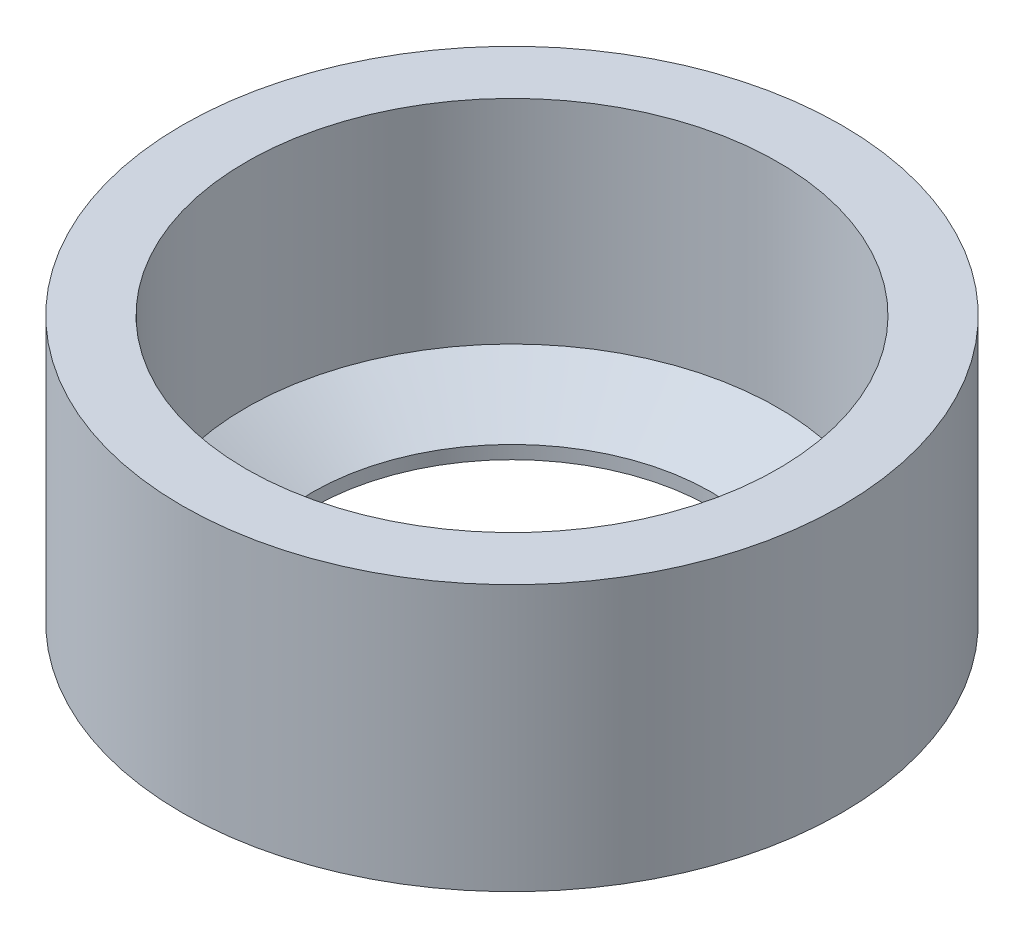
ISO-10303-21;
HEADER;
FILE_DESCRIPTION(('STEP AP214'),'2;1');
FILE_NAME('part.step','',(''),(''),'','','');
FILE_SCHEMA(('AUTOMOTIVE_DESIGN { 1 0 10303 214 1 1 1 1 }'));
ENDSEC;
DATA;
#1=APPLICATION_CONTEXT('core data for automotive mechanical design processes');
#2=APPLICATION_PROTOCOL_DEFINITION('international standard','automotive_design',2000,#1);
#3=PRODUCT_CONTEXT('',#1,'mechanical');
#4=PRODUCT('Part','Part','',(#3));
#5=PRODUCT_RELATED_PRODUCT_CATEGORY('part','',(#4));
#6=PRODUCT_DEFINITION_FORMATION('','',#4);
#7=PRODUCT_DEFINITION_CONTEXT('part definition',#1,'design');
#8=PRODUCT_DEFINITION('design','',#6,#7);
#9=PRODUCT_DEFINITION_SHAPE('','',#8);
#10=(LENGTH_UNIT() NAMED_UNIT(*) SI_UNIT(.MILLI.,.METRE.));
#11=(NAMED_UNIT(*) PLANE_ANGLE_UNIT() SI_UNIT($,.RADIAN.));
#12=(NAMED_UNIT(*) SI_UNIT($,.STERADIAN.) SOLID_ANGLE_UNIT());
#13=UNCERTAINTY_MEASURE_WITH_UNIT(LENGTH_MEASURE(1.E-05),#10,'distance_accuracy_value','');
#14=(GEOMETRIC_REPRESENTATION_CONTEXT(3) GLOBAL_UNCERTAINTY_ASSIGNED_CONTEXT((#13)) GLOBAL_UNIT_ASSIGNED_CONTEXT((#10,
#11,#12)) REPRESENTATION_CONTEXT('',''));
#15=CARTESIAN_POINT('',(0.,0.,0.));
#16=DIRECTION('',(0.,0.,1.));
#17=DIRECTION('',(1.,0.,0.));
#18=AXIS2_PLACEMENT_3D('',#15,#16,#17);
#19=CARTESIAN_POINT('',(0.,12.7,0.));
#20=DIRECTION('',(0.,-1.,0.));
#21=DIRECTION('',(0.,0.,-1.));
#22=AXIS2_PLACEMENT_3D('',#19,#20,#21);
#23=CYLINDRICAL_SURFACE('',#22,15.748);
#24=CARTESIAN_POINT('',(0.,12.7,0.));
#25=DIRECTION('',(0.,1.,0.));
#26=DIRECTION('',(0.,0.,1.));
#27=AXIS2_PLACEMENT_3D('',#24,#25,#26);
#28=CIRCLE('',#27,15.748);
#29=CARTESIAN_POINT('',(0.,12.7,15.748));
#30=VERTEX_POINT('',#29);
#31=EDGE_CURVE('E10',#30,#30,#28,.T.);
#32=ORIENTED_EDGE('',*,*,#31,.F.);
#33=EDGE_LOOP('',(#32));
#34=FACE_BOUND('',#33,.T.);
#35=CARTESIAN_POINT('',(0.,0.,0.));
#36=DIRECTION('',(0.,1.,0.));
#37=DIRECTION('',(0.,0.,1.));
#38=AXIS2_PLACEMENT_3D('',#35,#36,#37);
#39=CIRCLE('',#38,15.748);
#40=CARTESIAN_POINT('',(0.,0.,15.748));
#41=VERTEX_POINT('',#40);
#42=EDGE_CURVE('E42',#41,#41,#39,.T.);
#43=ORIENTED_EDGE('',*,*,#42,.T.);
#44=EDGE_LOOP('',(#43));
#45=FACE_BOUND('',#44,.T.);
#46=ADVANCED_FACE('F35',(#34,#45),#23,.T.);
#47=CARTESIAN_POINT('',(0.,12.7,0.));
#48=DIRECTION('',(0.,1.,0.));
#49=DIRECTION('',(0.,0.,1.));
#50=AXIS2_PLACEMENT_3D('',#47,#48,#49);
#51=PLANE('',#50);
#52=CARTESIAN_POINT('',(0.,12.7,0.));
#53=DIRECTION('',(0.,1.,0.));
#54=DIRECTION('',(0.,0.,1.));
#55=AXIS2_PLACEMENT_3D('',#52,#53,#54);
#56=CIRCLE('',#55,12.7);
#57=CARTESIAN_POINT('',(0.,12.7,12.7));
#58=VERTEX_POINT('',#57);
#59=EDGE_CURVE('E51',#58,#58,#56,.T.);
#60=ORIENTED_EDGE('',*,*,#59,.F.);
#61=EDGE_LOOP('',(#60));
#62=FACE_BOUND('',#61,.T.);
#63=ORIENTED_EDGE('',*,*,#31,.T.);
#64=EDGE_LOOP('',(#63));
#65=FACE_BOUND('',#64,.T.);
#66=ADVANCED_FACE('F75',(#62,#65),#51,.T.);
#67=CARTESIAN_POINT('',(0.,0.,0.));
#68=DIRECTION('',(0.,1.,0.));
#69=DIRECTION('',(0.,0.,1.));
#70=AXIS2_PLACEMENT_3D('',#67,#68,#69);
#71=PLANE('',#70);
#72=CARTESIAN_POINT('',(0.,0.,0.));
#73=DIRECTION('',(0.,1.,0.));
#74=DIRECTION('',(0.,0.,1.));
#75=AXIS2_PLACEMENT_3D('',#72,#73,#74);
#76=CIRCLE('',#75,9.525);
#77=CARTESIAN_POINT('',(0.,0.,9.525));
#78=VERTEX_POINT('',#77);
#79=EDGE_CURVE('E54',#78,#78,#76,.T.);
#80=ORIENTED_EDGE('',*,*,#79,.T.);
#81=EDGE_LOOP('',(#80));
#82=FACE_BOUND('',#81,.T.);
#83=ORIENTED_EDGE('',*,*,#42,.F.);
#84=EDGE_LOOP('',(#83));
#85=FACE_BOUND('',#84,.T.);
#86=ADVANCED_FACE('F80',(#82,#85),#71,.F.);
#87=CARTESIAN_POINT('',(0.,2.54,0.));
#88=DIRECTION('',(0.,1.,0.));
#89=DIRECTION('',(0.,0.,1.));
#90=AXIS2_PLACEMENT_3D('',#87,#88,#89);
#91=CONICAL_SURFACE('',#90,12.7,1.02974425867665);
#92=CARTESIAN_POINT('',(0.,0.632267534587491,0.));
#93=DIRECTION('',(0.,1.,0.));
#94=DIRECTION('',(0.,0.,1.));
#95=AXIS2_PLACEMENT_3D('',#92,#93,#94);
#96=CIRCLE('',#95,9.52499999999999);
#97=CARTESIAN_POINT('',(0.,0.632267534587491,9.52499999999999));
#98=VERTEX_POINT('',#97);
#99=EDGE_CURVE('E38',#98,#98,#96,.F.);
#100=ORIENTED_EDGE('',*,*,#99,.T.);
#101=EDGE_LOOP('',(#100));
#102=FACE_BOUND('',#101,.T.);
#103=CARTESIAN_POINT('',(0.,2.54,0.));
#104=DIRECTION('',(0.,1.,0.));
#105=DIRECTION('',(0.,0.,1.));
#106=AXIS2_PLACEMENT_3D('',#103,#104,#105);
#107=CIRCLE('',#106,12.7);
#108=CARTESIAN_POINT('',(0.,2.54,12.7));
#109=VERTEX_POINT('',#108);
#110=EDGE_CURVE('E47',#109,#109,#107,.T.);
#111=ORIENTED_EDGE('',*,*,#110,.T.);
#112=EDGE_LOOP('',(#111));
#113=FACE_BOUND('',#112,.T.);
#114=ADVANCED_FACE('F61',(#102,#113),#91,.F.);
#115=CARTESIAN_POINT('',(0.,12.7,0.));
#116=DIRECTION('',(0.,1.,0.));
#117=DIRECTION('',(0.,0.,1.));
#118=AXIS2_PLACEMENT_3D('',#115,#116,#117);
#119=CYLINDRICAL_SURFACE('',#118,12.7);
#120=ORIENTED_EDGE('',*,*,#110,.F.);
#121=EDGE_LOOP('',(#120));
#122=FACE_BOUND('',#121,.T.);
#123=ORIENTED_EDGE('',*,*,#59,.T.);
#124=EDGE_LOOP('',(#123));
#125=FACE_BOUND('',#124,.T.);
#126=ADVANCED_FACE('F66',(#122,#125),#119,.F.);
#127=CARTESIAN_POINT('',(0.,12.7,0.));
#128=DIRECTION('',(0.,1.,0.));
#129=DIRECTION('',(0.,0.,1.));
#130=AXIS2_PLACEMENT_3D('',#127,#128,#129);
#131=CYLINDRICAL_SURFACE('',#130,9.52499999999999);
#132=ORIENTED_EDGE('',*,*,#79,.F.);
#133=EDGE_LOOP('',(#132));
#134=FACE_BOUND('',#133,.T.);
#135=ORIENTED_EDGE('',*,*,#99,.F.);
#136=EDGE_LOOP('',(#135));
#137=FACE_BOUND('',#136,.T.);
#138=ADVANCED_FACE('F64',(#134,#137),#131,.F.);
#139=CLOSED_SHELL('',(#46,#66,#86,#114,#126,#138));
#140=MANIFOLD_SOLID_BREP('B2',#139);
#141=ADVANCED_BREP_SHAPE_REPRESENTATION('',(#18,#140),#14);
#142=SHAPE_DEFINITION_REPRESENTATION(#9,#141);
ENDSEC;
END-ISO-10303-21;
